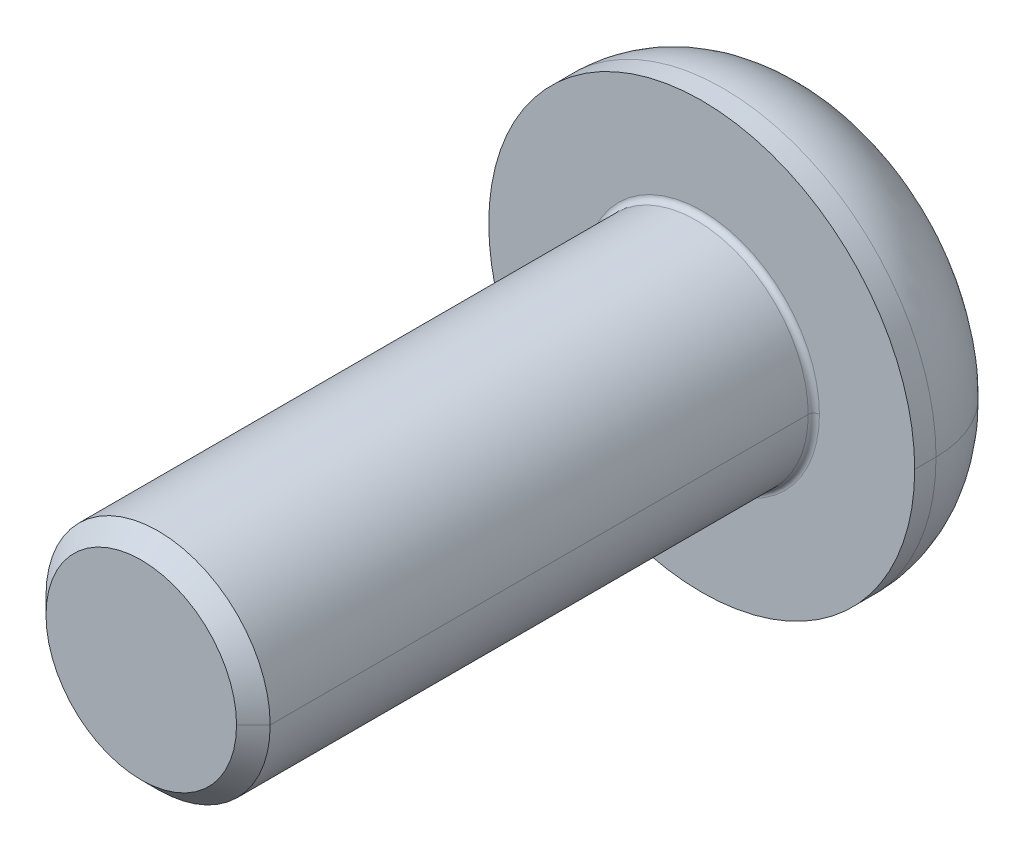
ISO-10303-21;
HEADER;
FILE_DESCRIPTION(('STEP AP214'),'2;1');
FILE_NAME('part.step','',(''),(''),'','','');
FILE_SCHEMA(('AUTOMOTIVE_DESIGN { 1 0 10303 214 1 1 1 1 }'));
ENDSEC;
DATA;
#1=APPLICATION_CONTEXT('core data for automotive mechanical design processes');
#2=APPLICATION_PROTOCOL_DEFINITION('international standard','automotive_design',2000,#1);
#3=PRODUCT_CONTEXT('',#1,'mechanical');
#4=PRODUCT('Part','Part','',(#3));
#5=PRODUCT_RELATED_PRODUCT_CATEGORY('part','',(#4));
#6=PRODUCT_DEFINITION_FORMATION('','',#4);
#7=PRODUCT_DEFINITION_CONTEXT('part definition',#1,'design');
#8=PRODUCT_DEFINITION('design','',#6,#7);
#9=PRODUCT_DEFINITION_SHAPE('','',#8);
#10=(LENGTH_UNIT() NAMED_UNIT(*) SI_UNIT(.MILLI.,.METRE.));
#11=(NAMED_UNIT(*) PLANE_ANGLE_UNIT() SI_UNIT($,.RADIAN.));
#12=(NAMED_UNIT(*) SI_UNIT($,.STERADIAN.) SOLID_ANGLE_UNIT());
#13=UNCERTAINTY_MEASURE_WITH_UNIT(LENGTH_MEASURE(1.E-05),#10,'distance_accuracy_value','');
#14=(GEOMETRIC_REPRESENTATION_CONTEXT(3) GLOBAL_UNCERTAINTY_ASSIGNED_CONTEXT((#13)) GLOBAL_UNIT_ASSIGNED_CONTEXT((#10,
#11,#12)) REPRESENTATION_CONTEXT('',''));
#15=CARTESIAN_POINT('',(0.,0.,0.));
#16=DIRECTION('',(0.,0.,1.));
#17=DIRECTION('',(1.,0.,0.));
#18=AXIS2_PLACEMENT_3D('',#15,#16,#17);
#19=CARTESIAN_POINT('',(0.,0.,0.1));
#20=DIRECTION('',(0.,0.,-1.));
#21=DIRECTION('',(-1.,0.,0.));
#22=AXIS2_PLACEMENT_3D('',#19,#20,#21);
#23=TOROIDAL_SURFACE('',#22,2.1,0.1);
#24=CARTESIAN_POINT('',(2.1,0.,0.1));
#25=DIRECTION('',(0.,1.,0.));
#26=DIRECTION('',(-1.,0.,0.));
#27=AXIS2_PLACEMENT_3D('',#24,#25,#26);
#28=CIRCLE('',#27,0.1);
#29=CARTESIAN_POINT('',(2.1,0.,0.));
#30=VERTEX_POINT('',#29);
#31=CARTESIAN_POINT('',(2.,0.,0.1));
#32=VERTEX_POINT('',#31);
#33=EDGE_CURVE('E158',#30,#32,#28,.T.);
#34=ORIENTED_EDGE('',*,*,#33,.F.);
#35=CARTESIAN_POINT('',(0.,0.,0.));
#36=DIRECTION('',(0.,0.,-1.));
#37=DIRECTION('',(-1.,0.,0.));
#38=AXIS2_PLACEMENT_3D('',#35,#36,#37);
#39=CIRCLE('',#38,2.1);
#40=CARTESIAN_POINT('',(-2.1,0.,0.));
#41=VERTEX_POINT('',#40);
#42=EDGE_CURVE('E144',#41,#30,#39,.T.);
#43=ORIENTED_EDGE('',*,*,#42,.F.);
#44=CARTESIAN_POINT('',(-2.1,0.,0.1));
#45=DIRECTION('',(0.,-1.,0.));
#46=DIRECTION('',(0.,0.,-1.));
#47=AXIS2_PLACEMENT_3D('',#44,#45,#46);
#48=CIRCLE('',#47,0.1);
#49=CARTESIAN_POINT('',(-2.,0.,0.1));
#50=VERTEX_POINT('',#49);
#51=EDGE_CURVE('E168',#41,#50,#48,.T.);
#52=ORIENTED_EDGE('',*,*,#51,.T.);
#53=CARTESIAN_POINT('',(0.,0.,0.1));
#54=DIRECTION('',(0.,0.,1.));
#55=DIRECTION('',(-1.,0.,0.));
#56=AXIS2_PLACEMENT_3D('',#53,#54,#55);
#57=CIRCLE('',#56,2.);
#58=EDGE_CURVE('E160',#32,#50,#57,.T.);
#59=ORIENTED_EDGE('',*,*,#58,.F.);
#60=EDGE_LOOP('',(#34,#43,#52,#59));
#61=FACE_BOUND('',#60,.T.);
#62=ADVANCED_FACE('F17',(#61),#23,.F.);
#63=CARTESIAN_POINT('',(0.,0.,-0.38));
#64=DIRECTION('',(0.,0.,-1.));
#65=DIRECTION('',(-1.,0.,0.));
#66=AXIS2_PLACEMENT_3D('',#63,#64,#65);
#67=TOROIDAL_SURFACE('',#66,1.98,1.82);
#68=CARTESIAN_POINT('',(1.98,0.,-0.38));
#69=DIRECTION('',(0.,1.,0.));
#70=DIRECTION('',(-1.,0.,0.));
#71=AXIS2_PLACEMENT_3D('',#68,#69,#70);
#72=CIRCLE('',#71,1.82);
#73=CARTESIAN_POINT('',(3.8,0.,-0.38));
#74=VERTEX_POINT('',#73);
#75=CARTESIAN_POINT('',(1.98,0.,-2.2));
#76=VERTEX_POINT('',#75);
#77=EDGE_CURVE('E195',#74,#76,#72,.T.);
#78=ORIENTED_EDGE('',*,*,#77,.F.);
#79=CARTESIAN_POINT('',(0.,0.,-0.38));
#80=DIRECTION('',(0.,0.,1.));
#81=DIRECTION('',(-1.,0.,0.));
#82=AXIS2_PLACEMENT_3D('',#79,#80,#81);
#83=CIRCLE('',#82,3.8);
#84=CARTESIAN_POINT('',(-3.8,0.,-0.38));
#85=VERTEX_POINT('',#84);
#86=EDGE_CURVE('E250',#85,#74,#83,.T.);
#87=ORIENTED_EDGE('',*,*,#86,.F.);
#88=CARTESIAN_POINT('',(-1.98,0.,-0.38));
#89=DIRECTION('',(0.,-1.,0.));
#90=DIRECTION('',(0.,0.,-1.));
#91=AXIS2_PLACEMENT_3D('',#88,#89,#90);
#92=CIRCLE('',#91,1.82);
#93=CARTESIAN_POINT('',(-1.98,0.,-2.2));
#94=VERTEX_POINT('',#93);
#95=EDGE_CURVE('E194',#85,#94,#92,.T.);
#96=ORIENTED_EDGE('',*,*,#95,.T.);
#97=CARTESIAN_POINT('',(0.,0.,-2.2));
#98=DIRECTION('',(0.,0.,-1.));
#99=DIRECTION('',(-1.,0.,0.));
#100=AXIS2_PLACEMENT_3D('',#97,#98,#99);
#101=CIRCLE('',#100,1.98);
#102=EDGE_CURVE('E256',#76,#94,#101,.T.);
#103=ORIENTED_EDGE('',*,*,#102,.F.);
#104=EDGE_LOOP('',(#78,#87,#96,#103));
#105=FACE_BOUND('',#104,.T.);
#106=ADVANCED_FACE('F19',(#105),#67,.T.);
#107=CARTESIAN_POINT('',(0.,0.,-0.9));
#108=DIRECTION('',(0.,0.,-1.));
#109=DIRECTION('',(0.,-1.,0.));
#110=AXIS2_PLACEMENT_3D('',#107,#108,#109);
#111=PLANE('',#110);
#112=DIRECTION('',(-1.,0.,0.));
#113=VECTOR('',#112,1.);
#114=CARTESIAN_POINT('',(0.721687836487032,-1.25,-0.9));
#115=LINE('',#114,#113);
#116=CARTESIAN_POINT('',(0.721687836487032,-1.25,-0.9));
#117=VERTEX_POINT('',#116);
#118=CARTESIAN_POINT('',(-0.721687836487032,-1.25,-0.9));
#119=VERTEX_POINT('',#118);
#120=EDGE_CURVE('E274',#117,#119,#115,.T.);
#121=ORIENTED_EDGE('',*,*,#120,.T.);
#122=DIRECTION('',(-0.5,0.866025403784439,0.));
#123=VECTOR('',#122,1.);
#124=CARTESIAN_POINT('',(-0.721687836487032,-1.25,-0.9));
#125=LINE('',#124,#123);
#126=CARTESIAN_POINT('',(-1.44337567297406,0.,-0.9));
#127=VERTEX_POINT('',#126);
#128=EDGE_CURVE('E11',#119,#127,#125,.T.);
#129=ORIENTED_EDGE('',*,*,#128,.T.);
#130=DIRECTION('',(0.5,0.866025403784439,0.));
#131=VECTOR('',#130,1.);
#132=CARTESIAN_POINT('',(-1.44337567297406,0.,-0.9));
#133=LINE('',#132,#131);
#134=CARTESIAN_POINT('',(-0.721687836487033,1.25,-0.9));
#135=VERTEX_POINT('',#134);
#136=EDGE_CURVE('E45',#127,#135,#133,.T.);
#137=ORIENTED_EDGE('',*,*,#136,.T.);
#138=DIRECTION('',(1.,0.,0.));
#139=VECTOR('',#138,1.);
#140=CARTESIAN_POINT('',(-0.721687836487033,1.25,-0.9));
#141=LINE('',#140,#139);
#142=CARTESIAN_POINT('',(0.721687836487032,1.25,-0.9));
#143=VERTEX_POINT('',#142);
#144=EDGE_CURVE('E249',#135,#143,#141,.T.);
#145=ORIENTED_EDGE('',*,*,#144,.T.);
#146=DIRECTION('',(0.5,-0.866025403784439,0.));
#147=VECTOR('',#146,1.);
#148=CARTESIAN_POINT('',(0.721687836487032,1.25,-0.9));
#149=LINE('',#148,#147);
#150=CARTESIAN_POINT('',(1.44337567297406,0.,-0.9));
#151=VERTEX_POINT('',#150);
#152=EDGE_CURVE('E283',#143,#151,#149,.T.);
#153=ORIENTED_EDGE('',*,*,#152,.T.);
#154=DIRECTION('',(-0.5,-0.866025403784439,0.));
#155=VECTOR('',#154,1.);
#156=CARTESIAN_POINT('',(1.44337567297406,0.,-0.9));
#157=LINE('',#156,#155);
#158=EDGE_CURVE('E280',#151,#117,#157,.T.);
#159=ORIENTED_EDGE('',*,*,#158,.T.);
#160=EDGE_LOOP('',(#121,#129,#137,#145,#153,#159));
#161=FACE_BOUND('',#160,.T.);
#162=ADVANCED_FACE('F314',(#161),#111,.T.);
#163=CARTESIAN_POINT('',(-0.721687836487032,-1.25,-0.9));
#164=DIRECTION('',(-0.866025403784439,-0.5,0.));
#165=DIRECTION('',(-0.5,0.866025403784439,0.));
#166=AXIS2_PLACEMENT_3D('',#163,#164,#165);
#167=PLANE('',#166);
#168=DIRECTION('',(-0.5,0.866025403784439,0.));
#169=VECTOR('',#168,1.);
#170=CARTESIAN_POINT('',(-0.721687836487032,-1.25,-2.2));
#171=LINE('',#170,#169);
#172=CARTESIAN_POINT('',(-0.721687836487032,-1.25,-2.2));
#173=VERTEX_POINT('',#172);
#174=CARTESIAN_POINT('',(-1.44337567297406,0.,-2.2));
#175=VERTEX_POINT('',#174);
#176=EDGE_CURVE('E155',#173,#175,#171,.T.);
#177=ORIENTED_EDGE('',*,*,#176,.T.);
#178=DIRECTION('',(0.,0.,-1.));
#179=VECTOR('',#178,1.);
#180=CARTESIAN_POINT('',(-1.44337567297406,0.,-0.9));
#181=LINE('',#180,#179);
#182=EDGE_CURVE('E26',#127,#175,#181,.T.);
#183=ORIENTED_EDGE('',*,*,#182,.F.);
#184=ORIENTED_EDGE('',*,*,#128,.F.);
#185=DIRECTION('',(0.,0.,-1.));
#186=VECTOR('',#185,1.);
#187=CARTESIAN_POINT('',(-0.721687836487032,-1.25,-0.9));
#188=LINE('',#187,#186);
#189=EDGE_CURVE('E154',#119,#173,#188,.T.);
#190=ORIENTED_EDGE('',*,*,#189,.T.);
#191=EDGE_LOOP('',(#177,#183,#184,#190));
#192=FACE_BOUND('',#191,.T.);
#193=ADVANCED_FACE('F301',(#192),#167,.F.);
#194=CARTESIAN_POINT('',(-1.44337567297406,0.,-0.9));
#195=DIRECTION('',(-0.866025403784439,0.5,0.));
#196=DIRECTION('',(0.,0.,1.));
#197=AXIS2_PLACEMENT_3D('',#194,#195,#196);
#198=PLANE('',#197);
#199=DIRECTION('',(0.5,0.866025403784439,0.));
#200=VECTOR('',#199,1.);
#201=CARTESIAN_POINT('',(-1.44337567297406,0.,-2.2));
#202=LINE('',#201,#200);
#203=CARTESIAN_POINT('',(-0.721687836487033,1.25,-2.2));
#204=VERTEX_POINT('',#203);
#205=EDGE_CURVE('E223',#175,#204,#202,.T.);
#206=ORIENTED_EDGE('',*,*,#205,.T.);
#207=DIRECTION('',(0.,0.,-1.));
#208=VECTOR('',#207,1.);
#209=CARTESIAN_POINT('',(-0.721687836487033,1.25,-0.9));
#210=LINE('',#209,#208);
#211=EDGE_CURVE('E246',#135,#204,#210,.T.);
#212=ORIENTED_EDGE('',*,*,#211,.F.);
#213=ORIENTED_EDGE('',*,*,#136,.F.);
#214=ORIENTED_EDGE('',*,*,#182,.T.);
#215=EDGE_LOOP('',(#206,#212,#213,#214));
#216=FACE_BOUND('',#215,.T.);
#217=ADVANCED_FACE('F296',(#216),#198,.F.);
#218=CARTESIAN_POINT('',(-0.721687836487033,1.25,-0.9));
#219=DIRECTION('',(0.,1.,0.));
#220=DIRECTION('',(1.,0.,0.));
#221=AXIS2_PLACEMENT_3D('',#218,#219,#220);
#222=PLANE('',#221);
#223=DIRECTION('',(1.,0.,0.));
#224=VECTOR('',#223,1.);
#225=CARTESIAN_POINT('',(-0.721687836487033,1.25,-2.2));
#226=LINE('',#225,#224);
#227=CARTESIAN_POINT('',(0.721687836487032,1.25,-2.2));
#228=VERTEX_POINT('',#227);
#229=EDGE_CURVE('E181',#204,#228,#226,.T.);
#230=ORIENTED_EDGE('',*,*,#229,.T.);
#231=DIRECTION('',(0.,0.,-1.));
#232=VECTOR('',#231,1.);
#233=CARTESIAN_POINT('',(0.721687836487032,1.25,-0.9));
#234=LINE('',#233,#232);
#235=EDGE_CURVE('E286',#143,#228,#234,.T.);
#236=ORIENTED_EDGE('',*,*,#235,.F.);
#237=ORIENTED_EDGE('',*,*,#144,.F.);
#238=ORIENTED_EDGE('',*,*,#211,.T.);
#239=EDGE_LOOP('',(#230,#236,#237,#238));
#240=FACE_BOUND('',#239,.T.);
#241=ADVANCED_FACE('F311',(#240),#222,.F.);
#242=CARTESIAN_POINT('',(0.721687836487032,1.25,-0.9));
#243=DIRECTION('',(0.866025403784439,0.5,0.));
#244=DIRECTION('',(0.,0.,-1.));
#245=AXIS2_PLACEMENT_3D('',#242,#243,#244);
#246=PLANE('',#245);
#247=DIRECTION('',(0.5,-0.866025403784439,0.));
#248=VECTOR('',#247,1.);
#249=CARTESIAN_POINT('',(0.721687836487032,1.25,-2.2));
#250=LINE('',#249,#248);
#251=CARTESIAN_POINT('',(1.44337567297406,0.,-2.2));
#252=VERTEX_POINT('',#251);
#253=EDGE_CURVE('E178',#228,#252,#250,.T.);
#254=ORIENTED_EDGE('',*,*,#253,.T.);
#255=DIRECTION('',(0.,0.,-1.));
#256=VECTOR('',#255,1.);
#257=CARTESIAN_POINT('',(1.44337567297406,0.,-0.9));
#258=LINE('',#257,#256);
#259=EDGE_CURVE('E176',#151,#252,#258,.T.);
#260=ORIENTED_EDGE('',*,*,#259,.F.);
#261=ORIENTED_EDGE('',*,*,#152,.F.);
#262=ORIENTED_EDGE('',*,*,#235,.T.);
#263=EDGE_LOOP('',(#254,#260,#261,#262));
#264=FACE_BOUND('',#263,.T.);
#265=ADVANCED_FACE('F319',(#264),#246,.F.);
#266=CARTESIAN_POINT('',(1.44337567297406,0.,-0.9));
#267=DIRECTION('',(0.866025403784439,-0.5,0.));
#268=DIRECTION('',(0.,0.,-1.));
#269=AXIS2_PLACEMENT_3D('',#266,#267,#268);
#270=PLANE('',#269);
#271=DIRECTION('',(-0.5,-0.866025403784439,0.));
#272=VECTOR('',#271,1.);
#273=CARTESIAN_POINT('',(1.44337567297406,0.,-2.2));
#274=LINE('',#273,#272);
#275=CARTESIAN_POINT('',(0.721687836487032,-1.25,-2.2));
#276=VERTEX_POINT('',#275);
#277=EDGE_CURVE('E182',#252,#276,#274,.T.);
#278=ORIENTED_EDGE('',*,*,#277,.T.);
#279=DIRECTION('',(0.,0.,-1.));
#280=VECTOR('',#279,1.);
#281=CARTESIAN_POINT('',(0.721687836487032,-1.25,-0.9));
#282=LINE('',#281,#280);
#283=EDGE_CURVE('E277',#117,#276,#282,.T.);
#284=ORIENTED_EDGE('',*,*,#283,.F.);
#285=ORIENTED_EDGE('',*,*,#158,.F.);
#286=ORIENTED_EDGE('',*,*,#259,.T.);
#287=EDGE_LOOP('',(#278,#284,#285,#286));
#288=FACE_BOUND('',#287,.T.);
#289=ADVANCED_FACE('F322',(#288),#270,.F.);
#290=CARTESIAN_POINT('',(0.721687836487032,-1.25,-0.9));
#291=DIRECTION('',(0.,-1.,0.));
#292=DIRECTION('',(-1.,0.,0.));
#293=AXIS2_PLACEMENT_3D('',#290,#291,#292);
#294=PLANE('',#293);
#295=DIRECTION('',(-1.,0.,0.));
#296=VECTOR('',#295,1.);
#297=CARTESIAN_POINT('',(0.721687836487032,-1.25,-2.2));
#298=LINE('',#297,#296);
#299=EDGE_CURVE('E259',#276,#173,#298,.T.);
#300=ORIENTED_EDGE('',*,*,#299,.T.);
#301=ORIENTED_EDGE('',*,*,#189,.F.);
#302=ORIENTED_EDGE('',*,*,#120,.F.);
#303=ORIENTED_EDGE('',*,*,#283,.T.);
#304=EDGE_LOOP('',(#300,#301,#302,#303));
#305=FACE_BOUND('',#304,.T.);
#306=ADVANCED_FACE('F325',(#305),#294,.F.);
#307=CARTESIAN_POINT('',(0.,0.,0.));
#308=DIRECTION('',(0.,0.,-1.));
#309=DIRECTION('',(0.,-1.,0.));
#310=AXIS2_PLACEMENT_3D('',#307,#308,#309);
#311=PLANE('',#310);
#312=ORIENTED_EDGE('',*,*,#42,.T.);
#313=CARTESIAN_POINT('',(0.,0.,0.));
#314=DIRECTION('',(0.,0.,-1.));
#315=DIRECTION('',(-1.,0.,0.));
#316=AXIS2_PLACEMENT_3D('',#313,#314,#315);
#317=CIRCLE('',#316,2.1);
#318=EDGE_CURVE('E149',#30,#41,#317,.T.);
#319=ORIENTED_EDGE('',*,*,#318,.T.);
#320=EDGE_LOOP('',(#312,#319));
#321=FACE_BOUND('',#320,.T.);
#322=CARTESIAN_POINT('',(0.,0.,0.));
#323=DIRECTION('',(0.,0.,-1.));
#324=DIRECTION('',(-1.,0.,0.));
#325=AXIS2_PLACEMENT_3D('',#322,#323,#324);
#326=CIRCLE('',#325,3.8);
#327=CARTESIAN_POINT('',(3.8,0.,0.));
#328=VERTEX_POINT('',#327);
#329=CARTESIAN_POINT('',(-3.8,0.,0.));
#330=VERTEX_POINT('',#329);
#331=EDGE_CURVE('E253',#328,#330,#326,.T.);
#332=ORIENTED_EDGE('',*,*,#331,.F.);
#333=CARTESIAN_POINT('',(0.,0.,0.));
#334=DIRECTION('',(0.,0.,-1.));
#335=DIRECTION('',(-1.,0.,0.));
#336=AXIS2_PLACEMENT_3D('',#333,#334,#335);
#337=CIRCLE('',#336,3.8);
#338=EDGE_CURVE('E216',#330,#328,#337,.T.);
#339=ORIENTED_EDGE('',*,*,#338,.F.);
#340=EDGE_LOOP('',(#332,#339));
#341=FACE_BOUND('',#340,.T.);
#342=ADVANCED_FACE('F146',(#321,#341),#311,.F.);
#343=CARTESIAN_POINT('',(0.,0.,-2.2));
#344=DIRECTION('',(0.,0.,-1.));
#345=DIRECTION('',(0.,-1.,0.));
#346=AXIS2_PLACEMENT_3D('',#343,#344,#345);
#347=PLANE('',#346);
#348=ORIENTED_EDGE('',*,*,#299,.F.);
#349=ORIENTED_EDGE('',*,*,#277,.F.);
#350=ORIENTED_EDGE('',*,*,#253,.F.);
#351=ORIENTED_EDGE('',*,*,#229,.F.);
#352=ORIENTED_EDGE('',*,*,#205,.F.);
#353=ORIENTED_EDGE('',*,*,#176,.F.);
#354=EDGE_LOOP('',(#348,#349,#350,#351,#352,#353));
#355=FACE_BOUND('',#354,.T.);
#356=CARTESIAN_POINT('',(0.,0.,-2.2));
#357=DIRECTION('',(0.,0.,-1.));
#358=DIRECTION('',(-1.,0.,0.));
#359=AXIS2_PLACEMENT_3D('',#356,#357,#358);
#360=CIRCLE('',#359,1.98);
#361=EDGE_CURVE('E190',#94,#76,#360,.T.);
#362=ORIENTED_EDGE('',*,*,#361,.T.);
#363=ORIENTED_EDGE('',*,*,#102,.T.);
#364=EDGE_LOOP('',(#362,#363));
#365=FACE_BOUND('',#364,.T.);
#366=ADVANCED_FACE('F305',(#355,#365),#347,.T.);
#367=CARTESIAN_POINT('',(0.,0.,-2.2));
#368=DIRECTION('',(0.,0.,1.));
#369=DIRECTION('',(1.,0.,0.));
#370=AXIS2_PLACEMENT_3D('',#367,#368,#369);
#371=CYLINDRICAL_SURFACE('',#370,3.8);
#372=DIRECTION('',(0.,0.,1.));
#373=VECTOR('',#372,1.);
#374=CARTESIAN_POINT('',(-3.8,0.,-2.2));
#375=LINE('',#374,#373);
#376=EDGE_CURVE('E211',#85,#330,#375,.T.);
#377=ORIENTED_EDGE('',*,*,#376,.F.);
#378=ORIENTED_EDGE('',*,*,#86,.T.);
#379=DIRECTION('',(0.,0.,1.));
#380=VECTOR('',#379,1.);
#381=CARTESIAN_POINT('',(3.8,0.,-2.2));
#382=LINE('',#381,#380);
#383=EDGE_CURVE('E220',#74,#328,#382,.T.);
#384=ORIENTED_EDGE('',*,*,#383,.T.);
#385=ORIENTED_EDGE('',*,*,#331,.T.);
#386=EDGE_LOOP('',(#377,#378,#384,#385));
#387=FACE_BOUND('',#386,.T.);
#388=ADVANCED_FACE('F347',(#387),#371,.T.);
#389=CARTESIAN_POINT('',(0.,0.,10.));
#390=DIRECTION('',(0.,0.,-1.));
#391=DIRECTION('',(-1.,0.,0.));
#392=AXIS2_PLACEMENT_3D('',#389,#390,#391);
#393=CONICAL_SURFACE('',#392,1.7,0.785398163397448);
#394=DIRECTION('',(0.707106781186548,0.,-0.707106781186548));
#395=VECTOR('',#394,1.);
#396=CARTESIAN_POINT('',(1.7,0.,10.));
#397=LINE('',#396,#395);
#398=CARTESIAN_POINT('',(1.7,0.,10.));
#399=VERTEX_POINT('',#398);
#400=CARTESIAN_POINT('',(2.,0.,9.7));
#401=VERTEX_POINT('',#400);
#402=EDGE_CURVE('E215',#399,#401,#397,.T.);
#403=ORIENTED_EDGE('',*,*,#402,.F.);
#404=CARTESIAN_POINT('',(0.,0.,10.));
#405=DIRECTION('',(0.,0.,1.));
#406=DIRECTION('',(1.,0.,0.));
#407=AXIS2_PLACEMENT_3D('',#404,#405,#406);
#408=CIRCLE('',#407,1.7);
#409=CARTESIAN_POINT('',(-1.7,0.,10.));
#410=VERTEX_POINT('',#409);
#411=EDGE_CURVE('E245',#410,#399,#408,.T.);
#412=ORIENTED_EDGE('',*,*,#411,.F.);
#413=DIRECTION('',(-0.707106781186548,0.,-0.707106781186548));
#414=VECTOR('',#413,1.);
#415=CARTESIAN_POINT('',(-1.7,0.,10.));
#416=LINE('',#415,#414);
#417=CARTESIAN_POINT('',(-2.,0.,9.7));
#418=VERTEX_POINT('',#417);
#419=EDGE_CURVE('E184',#410,#418,#416,.T.);
#420=ORIENTED_EDGE('',*,*,#419,.T.);
#421=CARTESIAN_POINT('',(0.,0.,9.7));
#422=DIRECTION('',(0.,0.,-1.));
#423=DIRECTION('',(1.,0.,0.));
#424=AXIS2_PLACEMENT_3D('',#421,#422,#423);
#425=CIRCLE('',#424,2.);
#426=EDGE_CURVE('E242',#401,#418,#425,.T.);
#427=ORIENTED_EDGE('',*,*,#426,.F.);
#428=EDGE_LOOP('',(#403,#412,#420,#427));
#429=FACE_BOUND('',#428,.T.);
#430=ADVANCED_FACE('F343',(#429),#393,.T.);
#431=CARTESIAN_POINT('',(0.,0.,10.));
#432=DIRECTION('',(0.,0.,1.));
#433=DIRECTION('',(1.,0.,0.));
#434=AXIS2_PLACEMENT_3D('',#431,#432,#433);
#435=PLANE('',#434);
#436=ORIENTED_EDGE('',*,*,#411,.T.);
#437=CARTESIAN_POINT('',(0.,0.,10.));
#438=DIRECTION('',(0.,0.,1.));
#439=DIRECTION('',(1.,0.,0.));
#440=AXIS2_PLACEMENT_3D('',#437,#438,#439);
#441=CIRCLE('',#440,1.7);
#442=EDGE_CURVE('E230',#399,#410,#441,.T.);
#443=ORIENTED_EDGE('',*,*,#442,.T.);
#444=EDGE_LOOP('',(#436,#443));
#445=FACE_BOUND('',#444,.T.);
#446=ADVANCED_FACE('F346',(#445),#435,.T.);
#447=CARTESIAN_POINT('',(0.,0.,10.));
#448=DIRECTION('',(0.,0.,-1.));
#449=DIRECTION('',(-1.,0.,0.));
#450=AXIS2_PLACEMENT_3D('',#447,#448,#449);
#451=CYLINDRICAL_SURFACE('',#450,2.);
#452=DIRECTION('',(0.,0.,-1.));
#453=VECTOR('',#452,1.);
#454=CARTESIAN_POINT('',(2.,0.,10.));
#455=LINE('',#454,#453);
#456=EDGE_CURVE('E188',#401,#32,#455,.T.);
#457=ORIENTED_EDGE('',*,*,#456,.F.);
#458=ORIENTED_EDGE('',*,*,#426,.T.);
#459=DIRECTION('',(0.,0.,-1.));
#460=VECTOR('',#459,1.);
#461=CARTESIAN_POINT('',(-2.,0.,10.));
#462=LINE('',#461,#460);
#463=EDGE_CURVE('E239',#418,#50,#462,.T.);
#464=ORIENTED_EDGE('',*,*,#463,.T.);
#465=CARTESIAN_POINT('',(0.,0.,0.1));
#466=DIRECTION('',(0.,0.,1.));
#467=DIRECTION('',(-1.,0.,0.));
#468=AXIS2_PLACEMENT_3D('',#465,#466,#467);
#469=CIRCLE('',#468,2.);
#470=EDGE_CURVE('E165',#50,#32,#469,.T.);
#471=ORIENTED_EDGE('',*,*,#470,.T.);
#472=EDGE_LOOP('',(#457,#458,#464,#471));
#473=FACE_BOUND('',#472,.T.);
#474=ADVANCED_FACE('F363',(#473),#451,.T.);
#475=CARTESIAN_POINT('',(0.,0.,10.));
#476=DIRECTION('',(0.,0.,-1.));
#477=DIRECTION('',(-1.,0.,0.));
#478=AXIS2_PLACEMENT_3D('',#475,#476,#477);
#479=CYLINDRICAL_SURFACE('',#478,2.);
#480=CARTESIAN_POINT('',(0.,0.,9.7));
#481=DIRECTION('',(0.,0.,-1.));
#482=DIRECTION('',(1.,0.,0.));
#483=AXIS2_PLACEMENT_3D('',#480,#481,#482);
#484=CIRCLE('',#483,2.);
#485=EDGE_CURVE('E189',#418,#401,#484,.T.);
#486=ORIENTED_EDGE('',*,*,#485,.T.);
#487=ORIENTED_EDGE('',*,*,#456,.T.);
#488=ORIENTED_EDGE('',*,*,#58,.T.);
#489=ORIENTED_EDGE('',*,*,#463,.F.);
#490=EDGE_LOOP('',(#486,#487,#488,#489));
#491=FACE_BOUND('',#490,.T.);
#492=ADVANCED_FACE('F368',(#491),#479,.T.);
#493=CARTESIAN_POINT('',(0.,0.,10.));
#494=DIRECTION('',(0.,0.,-1.));
#495=DIRECTION('',(-1.,0.,0.));
#496=AXIS2_PLACEMENT_3D('',#493,#494,#495);
#497=CONICAL_SURFACE('',#496,1.7,0.785398163397448);
#498=ORIENTED_EDGE('',*,*,#442,.F.);
#499=ORIENTED_EDGE('',*,*,#402,.T.);
#500=ORIENTED_EDGE('',*,*,#485,.F.);
#501=ORIENTED_EDGE('',*,*,#419,.F.);
#502=EDGE_LOOP('',(#498,#499,#500,#501));
#503=FACE_BOUND('',#502,.T.);
#504=ADVANCED_FACE('F372',(#503),#497,.T.);
#505=CARTESIAN_POINT('',(0.,0.,-2.2));
#506=DIRECTION('',(0.,0.,1.));
#507=DIRECTION('',(1.,0.,0.));
#508=AXIS2_PLACEMENT_3D('',#505,#506,#507);
#509=CYLINDRICAL_SURFACE('',#508,3.8);
#510=CARTESIAN_POINT('',(0.,0.,-0.38));
#511=DIRECTION('',(0.,0.,1.));
#512=DIRECTION('',(-1.,0.,0.));
#513=AXIS2_PLACEMENT_3D('',#510,#511,#512);
#514=CIRCLE('',#513,3.8);
#515=EDGE_CURVE('E201',#74,#85,#514,.T.);
#516=ORIENTED_EDGE('',*,*,#515,.T.);
#517=ORIENTED_EDGE('',*,*,#376,.T.);
#518=ORIENTED_EDGE('',*,*,#338,.T.);
#519=ORIENTED_EDGE('',*,*,#383,.F.);
#520=EDGE_LOOP('',(#516,#517,#518,#519));
#521=FACE_BOUND('',#520,.T.);
#522=ADVANCED_FACE('F376',(#521),#509,.T.);
#523=CARTESIAN_POINT('',(0.,0.,-0.38));
#524=DIRECTION('',(0.,0.,-1.));
#525=DIRECTION('',(-1.,0.,0.));
#526=AXIS2_PLACEMENT_3D('',#523,#524,#525);
#527=TOROIDAL_SURFACE('',#526,1.98,1.82);
#528=ORIENTED_EDGE('',*,*,#515,.F.);
#529=ORIENTED_EDGE('',*,*,#77,.T.);
#530=ORIENTED_EDGE('',*,*,#361,.F.);
#531=ORIENTED_EDGE('',*,*,#95,.F.);
#532=EDGE_LOOP('',(#528,#529,#530,#531));
#533=FACE_BOUND('',#532,.T.);
#534=ADVANCED_FACE('F384',(#533),#527,.T.);
#535=CARTESIAN_POINT('',(0.,0.,0.1));
#536=DIRECTION('',(0.,0.,-1.));
#537=DIRECTION('',(-1.,0.,0.));
#538=AXIS2_PLACEMENT_3D('',#535,#536,#537);
#539=TOROIDAL_SURFACE('',#538,2.1,0.1);
#540=ORIENTED_EDGE('',*,*,#318,.F.);
#541=ORIENTED_EDGE('',*,*,#33,.T.);
#542=ORIENTED_EDGE('',*,*,#470,.F.);
#543=ORIENTED_EDGE('',*,*,#51,.F.);
#544=EDGE_LOOP('',(#540,#541,#542,#543));
#545=FACE_BOUND('',#544,.T.);
#546=ADVANCED_FACE('F167',(#545),#539,.F.);
#547=CLOSED_SHELL('',(#62,#106,#162,#193,#217,#241,#265,#289,#306,#342,#366,#388,#430,#446,#474,
#492,#504,#522,#534,#546));
#548=MANIFOLD_SOLID_BREP('B1',#547);
#549=ADVANCED_BREP_SHAPE_REPRESENTATION('',(#18,#548),#14);
#550=SHAPE_DEFINITION_REPRESENTATION(#9,#549);
ENDSEC;
END-ISO-10303-21;
